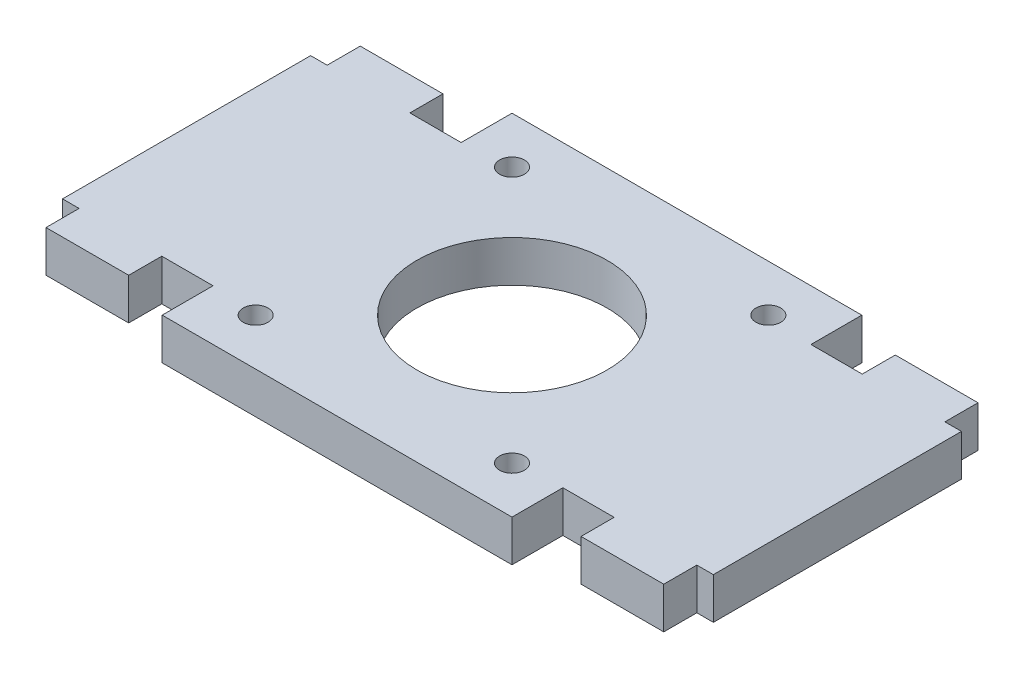
ISO-10303-21;
HEADER;
FILE_DESCRIPTION(('STEP AP214'),'2;1');
FILE_NAME('part.step','',(''),(''),'','','');
FILE_SCHEMA(('AUTOMOTIVE_DESIGN { 1 0 10303 214 1 1 1 1 }'));
ENDSEC;
DATA;
#1=APPLICATION_CONTEXT('core data for automotive mechanical design processes');
#2=APPLICATION_PROTOCOL_DEFINITION('international standard','automotive_design',2000,#1);
#3=PRODUCT_CONTEXT('',#1,'mechanical');
#4=PRODUCT('Part','Part','',(#3));
#5=PRODUCT_RELATED_PRODUCT_CATEGORY('part','',(#4));
#6=PRODUCT_DEFINITION_FORMATION('','',#4);
#7=PRODUCT_DEFINITION_CONTEXT('part definition',#1,'design');
#8=PRODUCT_DEFINITION('design','',#6,#7);
#9=PRODUCT_DEFINITION_SHAPE('','',#8);
#10=(LENGTH_UNIT() NAMED_UNIT(*) SI_UNIT(.MILLI.,.METRE.));
#11=(NAMED_UNIT(*) PLANE_ANGLE_UNIT() SI_UNIT($,.RADIAN.));
#12=(NAMED_UNIT(*) SI_UNIT($,.STERADIAN.) SOLID_ANGLE_UNIT());
#13=UNCERTAINTY_MEASURE_WITH_UNIT(LENGTH_MEASURE(1.E-05),#10,'distance_accuracy_value','');
#14=(GEOMETRIC_REPRESENTATION_CONTEXT(3) GLOBAL_UNCERTAINTY_ASSIGNED_CONTEXT((#13)) GLOBAL_UNIT_ASSIGNED_CONTEXT((#10,
#11,#12)) REPRESENTATION_CONTEXT('',''));
#15=CARTESIAN_POINT('',(0.,0.,0.));
#16=DIRECTION('',(0.,0.,1.));
#17=DIRECTION('',(1.,0.,0.));
#18=AXIS2_PLACEMENT_3D('',#15,#16,#17);
#19=CARTESIAN_POINT('',(0.,5.,15.));
#20=DIRECTION('',(0.,0.,-1.));
#21=DIRECTION('',(-1.,0.,0.));
#22=AXIS2_PLACEMENT_3D('',#19,#20,#21);
#23=PLANE('',#22);
#24=DIRECTION('',(1.,0.,0.));
#25=VECTOR('',#24,1.);
#26=CARTESIAN_POINT('',(0.,0.,15.));
#27=LINE('',#26,#25);
#28=CARTESIAN_POINT('',(-27.35,0.,15.));
#29=VERTEX_POINT('',#28);
#30=CARTESIAN_POINT('',(-21.15,0.,15.));
#31=VERTEX_POINT('',#30);
#32=EDGE_CURVE('E269',#29,#31,#27,.T.);
#33=ORIENTED_EDGE('',*,*,#32,.T.);
#34=DIRECTION('',(0.,-1.,0.));
#35=VECTOR('',#34,1.);
#36=CARTESIAN_POINT('',(-21.15,5.,15.));
#37=LINE('',#36,#35);
#38=CARTESIAN_POINT('',(-21.15,5.,15.));
#39=VERTEX_POINT('',#38);
#40=EDGE_CURVE('E11',#39,#31,#37,.T.);
#41=ORIENTED_EDGE('',*,*,#40,.F.);
#42=DIRECTION('',(1.,0.,0.));
#43=VECTOR('',#42,1.);
#44=CARTESIAN_POINT('',(0.,5.,15.));
#45=LINE('',#44,#43);
#46=CARTESIAN_POINT('',(-27.35,5.,15.));
#47=VERTEX_POINT('',#46);
#48=EDGE_CURVE('E479',#47,#39,#45,.T.);
#49=ORIENTED_EDGE('',*,*,#48,.F.);
#50=DIRECTION('',(0.,-1.,0.));
#51=VECTOR('',#50,1.);
#52=CARTESIAN_POINT('',(-27.35,5.,15.));
#53=LINE('',#52,#51);
#54=EDGE_CURVE('E250',#47,#29,#53,.T.);
#55=ORIENTED_EDGE('',*,*,#54,.T.);
#56=EDGE_LOOP('',(#33,#41,#49,#55));
#57=FACE_BOUND('',#56,.T.);
#58=ADVANCED_FACE('F37',(#57),#23,.F.);
#59=CARTESIAN_POINT('',(-21.15,5.,0.));
#60=DIRECTION('',(1.,0.,0.));
#61=DIRECTION('',(0.,0.,-1.));
#62=AXIS2_PLACEMENT_3D('',#59,#60,#61);
#63=PLANE('',#62);
#64=DIRECTION('',(0.,0.,1.));
#65=VECTOR('',#64,1.);
#66=CARTESIAN_POINT('',(-21.15,0.,0.));
#67=LINE('',#66,#65);
#68=CARTESIAN_POINT('',(-21.15,0.,21.15));
#69=VERTEX_POINT('',#68);
#70=EDGE_CURVE('E272',#31,#69,#67,.T.);
#71=ORIENTED_EDGE('',*,*,#70,.T.);
#72=DIRECTION('',(0.,-1.,0.));
#73=VECTOR('',#72,1.);
#74=CARTESIAN_POINT('',(-21.15,5.,21.15));
#75=LINE('',#74,#73);
#76=CARTESIAN_POINT('',(-21.15,5.,21.15));
#77=VERTEX_POINT('',#76);
#78=EDGE_CURVE('E46',#77,#69,#75,.T.);
#79=ORIENTED_EDGE('',*,*,#78,.F.);
#80=DIRECTION('',(0.,0.,1.));
#81=VECTOR('',#80,1.);
#82=CARTESIAN_POINT('',(-21.15,5.,0.));
#83=LINE('',#82,#81);
#84=EDGE_CURVE('E157',#39,#77,#83,.T.);
#85=ORIENTED_EDGE('',*,*,#84,.F.);
#86=ORIENTED_EDGE('',*,*,#40,.T.);
#87=EDGE_LOOP('',(#71,#79,#85,#86));
#88=FACE_BOUND('',#87,.T.);
#89=ADVANCED_FACE('F494',(#88),#63,.F.);
#90=CARTESIAN_POINT('',(0.,5.,21.15));
#91=DIRECTION('',(0.,0.,-1.));
#92=DIRECTION('',(-1.,0.,0.));
#93=AXIS2_PLACEMENT_3D('',#90,#91,#92);
#94=PLANE('',#93);
#95=DIRECTION('',(1.,0.,0.));
#96=VECTOR('',#95,1.);
#97=CARTESIAN_POINT('',(0.,0.,21.15));
#98=LINE('',#97,#96);
#99=CARTESIAN_POINT('',(21.15,0.,21.15));
#100=VERTEX_POINT('',#99);
#101=EDGE_CURVE('E274',#69,#100,#98,.T.);
#102=ORIENTED_EDGE('',*,*,#101,.T.);
#103=DIRECTION('',(0.,-1.,0.));
#104=VECTOR('',#103,1.);
#105=CARTESIAN_POINT('',(21.15,5.,21.15));
#106=LINE('',#105,#104);
#107=CARTESIAN_POINT('',(21.15,5.,21.15));
#108=VERTEX_POINT('',#107);
#109=EDGE_CURVE('E391',#108,#100,#106,.T.);
#110=ORIENTED_EDGE('',*,*,#109,.F.);
#111=DIRECTION('',(1.,0.,0.));
#112=VECTOR('',#111,1.);
#113=CARTESIAN_POINT('',(0.,5.,21.15));
#114=LINE('',#113,#112);
#115=EDGE_CURVE('E398',#77,#108,#114,.T.);
#116=ORIENTED_EDGE('',*,*,#115,.F.);
#117=ORIENTED_EDGE('',*,*,#78,.T.);
#118=EDGE_LOOP('',(#102,#110,#116,#117));
#119=FACE_BOUND('',#118,.T.);
#120=ADVANCED_FACE('F396',(#119),#94,.F.);
#121=CARTESIAN_POINT('',(21.15,5.,0.));
#122=DIRECTION('',(1.,0.,0.));
#123=DIRECTION('',(0.,0.,-1.));
#124=AXIS2_PLACEMENT_3D('',#121,#122,#123);
#125=PLANE('',#124);
#126=DIRECTION('',(0.,0.,1.));
#127=VECTOR('',#126,1.);
#128=CARTESIAN_POINT('',(21.15,0.,0.));
#129=LINE('',#128,#127);
#130=CARTESIAN_POINT('',(21.15,0.,15.));
#131=VERTEX_POINT('',#130);
#132=EDGE_CURVE('E277',#131,#100,#129,.T.);
#133=ORIENTED_EDGE('',*,*,#132,.F.);
#134=DIRECTION('',(0.,-1.,0.));
#135=VECTOR('',#134,1.);
#136=CARTESIAN_POINT('',(21.15,5.,15.));
#137=LINE('',#136,#135);
#138=CARTESIAN_POINT('',(21.15,5.,15.));
#139=VERTEX_POINT('',#138);
#140=EDGE_CURVE('E389',#139,#131,#137,.T.);
#141=ORIENTED_EDGE('',*,*,#140,.F.);
#142=DIRECTION('',(0.,0.,1.));
#143=VECTOR('',#142,1.);
#144=CARTESIAN_POINT('',(21.15,5.,0.));
#145=LINE('',#144,#143);
#146=EDGE_CURVE('E408',#139,#108,#145,.T.);
#147=ORIENTED_EDGE('',*,*,#146,.T.);
#148=ORIENTED_EDGE('',*,*,#109,.T.);
#149=EDGE_LOOP('',(#133,#141,#147,#148));
#150=FACE_BOUND('',#149,.T.);
#151=ADVANCED_FACE('F405',(#150),#125,.T.);
#152=CARTESIAN_POINT('',(0.,5.,15.));
#153=DIRECTION('',(0.,0.,1.));
#154=DIRECTION('',(1.,0.,0.));
#155=AXIS2_PLACEMENT_3D('',#152,#153,#154);
#156=PLANE('',#155);
#157=DIRECTION('',(-1.,0.,0.));
#158=VECTOR('',#157,1.);
#159=CARTESIAN_POINT('',(0.,0.,15.));
#160=LINE('',#159,#158);
#161=CARTESIAN_POINT('',(27.35,0.,15.));
#162=VERTEX_POINT('',#161);
#163=EDGE_CURVE('E280',#162,#131,#160,.T.);
#164=ORIENTED_EDGE('',*,*,#163,.F.);
#165=DIRECTION('',(0.,-1.,0.));
#166=VECTOR('',#165,1.);
#167=CARTESIAN_POINT('',(27.35,5.,15.));
#168=LINE('',#167,#166);
#169=CARTESIAN_POINT('',(27.35,5.,15.));
#170=VERTEX_POINT('',#169);
#171=EDGE_CURVE('E387',#170,#162,#168,.T.);
#172=ORIENTED_EDGE('',*,*,#171,.F.);
#173=DIRECTION('',(-1.,0.,0.));
#174=VECTOR('',#173,1.);
#175=CARTESIAN_POINT('',(0.,5.,15.));
#176=LINE('',#175,#174);
#177=EDGE_CURVE('E411',#170,#139,#176,.T.);
#178=ORIENTED_EDGE('',*,*,#177,.T.);
#179=ORIENTED_EDGE('',*,*,#140,.T.);
#180=EDGE_LOOP('',(#164,#172,#178,#179));
#181=FACE_BOUND('',#180,.T.);
#182=ADVANCED_FACE('F813',(#181),#156,.T.);
#183=CARTESIAN_POINT('',(27.35,5.,0.));
#184=DIRECTION('',(-1.,0.,0.));
#185=DIRECTION('',(0.,0.,1.));
#186=AXIS2_PLACEMENT_3D('',#183,#184,#185);
#187=PLANE('',#186);
#188=DIRECTION('',(0.,0.,-1.));
#189=VECTOR('',#188,1.);
#190=CARTESIAN_POINT('',(27.35,0.,0.));
#191=LINE('',#190,#189);
#192=CARTESIAN_POINT('',(27.35,0.,19.));
#193=VERTEX_POINT('',#192);
#194=EDGE_CURVE('E283',#193,#162,#191,.T.);
#195=ORIENTED_EDGE('',*,*,#194,.F.);
#196=DIRECTION('',(0.,-1.,0.));
#197=VECTOR('',#196,1.);
#198=CARTESIAN_POINT('',(27.35,5.,19.));
#199=LINE('',#198,#197);
#200=CARTESIAN_POINT('',(27.35,5.,19.));
#201=VERTEX_POINT('',#200);
#202=EDGE_CURVE('E385',#201,#193,#199,.T.);
#203=ORIENTED_EDGE('',*,*,#202,.F.);
#204=DIRECTION('',(0.,0.,-1.));
#205=VECTOR('',#204,1.);
#206=CARTESIAN_POINT('',(27.35,5.,0.));
#207=LINE('',#206,#205);
#208=EDGE_CURVE('E413',#201,#170,#207,.T.);
#209=ORIENTED_EDGE('',*,*,#208,.T.);
#210=ORIENTED_EDGE('',*,*,#171,.T.);
#211=EDGE_LOOP('',(#195,#203,#209,#210));
#212=FACE_BOUND('',#211,.T.);
#213=ADVANCED_FACE('F802',(#212),#187,.T.);
#214=CARTESIAN_POINT('',(0.,5.,19.));
#215=DIRECTION('',(0.,0.,1.));
#216=DIRECTION('',(1.,0.,0.));
#217=AXIS2_PLACEMENT_3D('',#214,#215,#216);
#218=PLANE('',#217);
#219=DIRECTION('',(-1.,0.,0.));
#220=VECTOR('',#219,1.);
#221=CARTESIAN_POINT('',(0.,0.,19.));
#222=LINE('',#221,#220);
#223=CARTESIAN_POINT('',(37.35,0.,19.));
#224=VERTEX_POINT('',#223);
#225=EDGE_CURVE('E286',#224,#193,#222,.T.);
#226=ORIENTED_EDGE('',*,*,#225,.F.);
#227=DIRECTION('',(0.,-1.,0.));
#228=VECTOR('',#227,1.);
#229=CARTESIAN_POINT('',(37.35,5.,19.));
#230=LINE('',#229,#228);
#231=CARTESIAN_POINT('',(37.35,5.,19.));
#232=VERTEX_POINT('',#231);
#233=EDGE_CURVE('E383',#232,#224,#230,.T.);
#234=ORIENTED_EDGE('',*,*,#233,.F.);
#235=DIRECTION('',(-1.,0.,0.));
#236=VECTOR('',#235,1.);
#237=CARTESIAN_POINT('',(0.,5.,19.));
#238=LINE('',#237,#236);
#239=EDGE_CURVE('E420',#232,#201,#238,.T.);
#240=ORIENTED_EDGE('',*,*,#239,.T.);
#241=ORIENTED_EDGE('',*,*,#202,.T.);
#242=EDGE_LOOP('',(#226,#234,#240,#241));
#243=FACE_BOUND('',#242,.T.);
#244=ADVANCED_FACE('F791',(#243),#218,.T.);
#245=CARTESIAN_POINT('',(37.35,5.,0.));
#246=DIRECTION('',(1.,0.,0.));
#247=DIRECTION('',(0.,0.,-1.));
#248=AXIS2_PLACEMENT_3D('',#245,#246,#247);
#249=PLANE('',#248);
#250=DIRECTION('',(0.,0.,1.));
#251=VECTOR('',#250,1.);
#252=CARTESIAN_POINT('',(37.35,0.,0.));
#253=LINE('',#252,#251);
#254=CARTESIAN_POINT('',(37.35,0.,15.));
#255=VERTEX_POINT('',#254);
#256=EDGE_CURVE('E289',#255,#224,#253,.T.);
#257=ORIENTED_EDGE('',*,*,#256,.F.);
#258=DIRECTION('',(0.,-1.,0.));
#259=VECTOR('',#258,1.);
#260=CARTESIAN_POINT('',(37.35,5.,15.));
#261=LINE('',#260,#259);
#262=CARTESIAN_POINT('',(37.35,5.,15.));
#263=VERTEX_POINT('',#262);
#264=EDGE_CURVE('E381',#263,#255,#261,.T.);
#265=ORIENTED_EDGE('',*,*,#264,.F.);
#266=DIRECTION('',(0.,0.,1.));
#267=VECTOR('',#266,1.);
#268=CARTESIAN_POINT('',(37.35,5.,0.));
#269=LINE('',#268,#267);
#270=EDGE_CURVE('E423',#263,#232,#269,.T.);
#271=ORIENTED_EDGE('',*,*,#270,.T.);
#272=ORIENTED_EDGE('',*,*,#233,.T.);
#273=EDGE_LOOP('',(#257,#265,#271,#272));
#274=FACE_BOUND('',#273,.T.);
#275=ADVANCED_FACE('F780',(#274),#249,.T.);
#276=CARTESIAN_POINT('',(0.,5.,15.));
#277=DIRECTION('',(0.,0.,1.));
#278=DIRECTION('',(1.,0.,0.));
#279=AXIS2_PLACEMENT_3D('',#276,#277,#278);
#280=PLANE('',#279);
#281=DIRECTION('',(-1.,0.,0.));
#282=VECTOR('',#281,1.);
#283=CARTESIAN_POINT('',(0.,0.,15.));
#284=LINE('',#283,#282);
#285=CARTESIAN_POINT('',(39.35,0.,15.));
#286=VERTEX_POINT('',#285);
#287=EDGE_CURVE('E292',#286,#255,#284,.T.);
#288=ORIENTED_EDGE('',*,*,#287,.F.);
#289=DIRECTION('',(0.,-1.,0.));
#290=VECTOR('',#289,1.);
#291=CARTESIAN_POINT('',(39.35,5.,15.));
#292=LINE('',#291,#290);
#293=CARTESIAN_POINT('',(39.35,5.,15.));
#294=VERTEX_POINT('',#293);
#295=EDGE_CURVE('E379',#294,#286,#292,.T.);
#296=ORIENTED_EDGE('',*,*,#295,.F.);
#297=DIRECTION('',(-1.,0.,0.));
#298=VECTOR('',#297,1.);
#299=CARTESIAN_POINT('',(0.,5.,15.));
#300=LINE('',#299,#298);
#301=EDGE_CURVE('E426',#294,#263,#300,.T.);
#302=ORIENTED_EDGE('',*,*,#301,.T.);
#303=ORIENTED_EDGE('',*,*,#264,.T.);
#304=EDGE_LOOP('',(#288,#296,#302,#303));
#305=FACE_BOUND('',#304,.T.);
#306=ADVANCED_FACE('F769',(#305),#280,.T.);
#307=CARTESIAN_POINT('',(39.35,5.,0.));
#308=DIRECTION('',(1.,0.,0.));
#309=DIRECTION('',(0.,0.,-1.));
#310=AXIS2_PLACEMENT_3D('',#307,#308,#309);
#311=PLANE('',#310);
#312=DIRECTION('',(0.,0.,1.));
#313=VECTOR('',#312,1.);
#314=CARTESIAN_POINT('',(39.35,0.,0.));
#315=LINE('',#314,#313);
#316=CARTESIAN_POINT('',(39.35,0.,-15.));
#317=VERTEX_POINT('',#316);
#318=EDGE_CURVE('E295',#317,#286,#315,.T.);
#319=ORIENTED_EDGE('',*,*,#318,.F.);
#320=DIRECTION('',(0.,-1.,0.));
#321=VECTOR('',#320,1.);
#322=CARTESIAN_POINT('',(39.35,5.,-15.));
#323=LINE('',#322,#321);
#324=CARTESIAN_POINT('',(39.35,5.,-15.));
#325=VERTEX_POINT('',#324);
#326=EDGE_CURVE('E377',#325,#317,#323,.T.);
#327=ORIENTED_EDGE('',*,*,#326,.F.);
#328=DIRECTION('',(0.,0.,1.));
#329=VECTOR('',#328,1.);
#330=CARTESIAN_POINT('',(39.35,5.,0.));
#331=LINE('',#330,#329);
#332=EDGE_CURVE('E429',#325,#294,#331,.T.);
#333=ORIENTED_EDGE('',*,*,#332,.T.);
#334=ORIENTED_EDGE('',*,*,#295,.T.);
#335=EDGE_LOOP('',(#319,#327,#333,#334));
#336=FACE_BOUND('',#335,.T.);
#337=ADVANCED_FACE('F758',(#336),#311,.T.);
#338=CARTESIAN_POINT('',(0.,5.,-15.));
#339=DIRECTION('',(0.,0.,1.));
#340=DIRECTION('',(1.,0.,0.));
#341=AXIS2_PLACEMENT_3D('',#338,#339,#340);
#342=PLANE('',#341);
#343=DIRECTION('',(-1.,0.,0.));
#344=VECTOR('',#343,1.);
#345=CARTESIAN_POINT('',(0.,0.,-15.));
#346=LINE('',#345,#344);
#347=CARTESIAN_POINT('',(37.35,0.,-15.));
#348=VERTEX_POINT('',#347);
#349=EDGE_CURVE('E298',#317,#348,#346,.T.);
#350=ORIENTED_EDGE('',*,*,#349,.T.);
#351=DIRECTION('',(0.,-1.,0.));
#352=VECTOR('',#351,1.);
#353=CARTESIAN_POINT('',(37.35,5.,-15.));
#354=LINE('',#353,#352);
#355=CARTESIAN_POINT('',(37.35,5.,-15.));
#356=VERTEX_POINT('',#355);
#357=EDGE_CURVE('E374',#356,#348,#354,.T.);
#358=ORIENTED_EDGE('',*,*,#357,.F.);
#359=DIRECTION('',(-1.,0.,0.));
#360=VECTOR('',#359,1.);
#361=CARTESIAN_POINT('',(0.,5.,-15.));
#362=LINE('',#361,#360);
#363=EDGE_CURVE('E432',#325,#356,#362,.T.);
#364=ORIENTED_EDGE('',*,*,#363,.F.);
#365=ORIENTED_EDGE('',*,*,#326,.T.);
#366=EDGE_LOOP('',(#350,#358,#364,#365));
#367=FACE_BOUND('',#366,.T.);
#368=ADVANCED_FACE('F747',(#367),#342,.F.);
#369=CARTESIAN_POINT('',(37.35,5.,0.));
#370=DIRECTION('',(-1.,0.,0.));
#371=DIRECTION('',(0.,0.,1.));
#372=AXIS2_PLACEMENT_3D('',#369,#370,#371);
#373=PLANE('',#372);
#374=DIRECTION('',(0.,0.,-1.));
#375=VECTOR('',#374,1.);
#376=CARTESIAN_POINT('',(37.35,0.,0.));
#377=LINE('',#376,#375);
#378=CARTESIAN_POINT('',(37.35,0.,-19.));
#379=VERTEX_POINT('',#378);
#380=EDGE_CURVE('E300',#348,#379,#377,.T.);
#381=ORIENTED_EDGE('',*,*,#380,.T.);
#382=DIRECTION('',(0.,-1.,0.));
#383=VECTOR('',#382,1.);
#384=CARTESIAN_POINT('',(37.35,5.,-19.));
#385=LINE('',#384,#383);
#386=CARTESIAN_POINT('',(37.35,5.,-19.));
#387=VERTEX_POINT('',#386);
#388=EDGE_CURVE('E371',#387,#379,#385,.T.);
#389=ORIENTED_EDGE('',*,*,#388,.F.);
#390=DIRECTION('',(0.,0.,-1.));
#391=VECTOR('',#390,1.);
#392=CARTESIAN_POINT('',(37.35,5.,0.));
#393=LINE('',#392,#391);
#394=EDGE_CURVE('E434',#356,#387,#393,.T.);
#395=ORIENTED_EDGE('',*,*,#394,.F.);
#396=ORIENTED_EDGE('',*,*,#357,.T.);
#397=EDGE_LOOP('',(#381,#389,#395,#396));
#398=FACE_BOUND('',#397,.T.);
#399=ADVANCED_FACE('F736',(#398),#373,.F.);
#400=CARTESIAN_POINT('',(0.,5.,-19.));
#401=DIRECTION('',(0.,0.,1.));
#402=DIRECTION('',(1.,0.,0.));
#403=AXIS2_PLACEMENT_3D('',#400,#401,#402);
#404=PLANE('',#403);
#405=DIRECTION('',(-1.,0.,0.));
#406=VECTOR('',#405,1.);
#407=CARTESIAN_POINT('',(0.,0.,-19.));
#408=LINE('',#407,#406);
#409=CARTESIAN_POINT('',(27.35,0.,-19.));
#410=VERTEX_POINT('',#409);
#411=EDGE_CURVE('E302',#379,#410,#408,.T.);
#412=ORIENTED_EDGE('',*,*,#411,.T.);
#413=DIRECTION('',(0.,-1.,0.));
#414=VECTOR('',#413,1.);
#415=CARTESIAN_POINT('',(27.35,5.,-19.));
#416=LINE('',#415,#414);
#417=CARTESIAN_POINT('',(27.35,5.,-19.));
#418=VERTEX_POINT('',#417);
#419=EDGE_CURVE('E368',#418,#410,#416,.T.);
#420=ORIENTED_EDGE('',*,*,#419,.F.);
#421=DIRECTION('',(-1.,0.,0.));
#422=VECTOR('',#421,1.);
#423=CARTESIAN_POINT('',(0.,5.,-19.));
#424=LINE('',#423,#422);
#425=EDGE_CURVE('E436',#387,#418,#424,.T.);
#426=ORIENTED_EDGE('',*,*,#425,.F.);
#427=ORIENTED_EDGE('',*,*,#388,.T.);
#428=EDGE_LOOP('',(#412,#420,#426,#427));
#429=FACE_BOUND('',#428,.T.);
#430=ADVANCED_FACE('F725',(#429),#404,.F.);
#431=CARTESIAN_POINT('',(27.35,5.,0.));
#432=DIRECTION('',(1.,0.,0.));
#433=DIRECTION('',(0.,0.,-1.));
#434=AXIS2_PLACEMENT_3D('',#431,#432,#433);
#435=PLANE('',#434);
#436=DIRECTION('',(0.,0.,1.));
#437=VECTOR('',#436,1.);
#438=CARTESIAN_POINT('',(27.35,0.,0.));
#439=LINE('',#438,#437);
#440=CARTESIAN_POINT('',(27.35,0.,-15.));
#441=VERTEX_POINT('',#440);
#442=EDGE_CURVE('E304',#410,#441,#439,.T.);
#443=ORIENTED_EDGE('',*,*,#442,.T.);
#444=DIRECTION('',(0.,-1.,0.));
#445=VECTOR('',#444,1.);
#446=CARTESIAN_POINT('',(27.35,5.,-15.));
#447=LINE('',#446,#445);
#448=CARTESIAN_POINT('',(27.35,5.,-15.));
#449=VERTEX_POINT('',#448);
#450=EDGE_CURVE('E365',#449,#441,#447,.T.);
#451=ORIENTED_EDGE('',*,*,#450,.F.);
#452=DIRECTION('',(0.,0.,1.));
#453=VECTOR('',#452,1.);
#454=CARTESIAN_POINT('',(27.35,5.,0.));
#455=LINE('',#454,#453);
#456=EDGE_CURVE('E438',#418,#449,#455,.T.);
#457=ORIENTED_EDGE('',*,*,#456,.F.);
#458=ORIENTED_EDGE('',*,*,#419,.T.);
#459=EDGE_LOOP('',(#443,#451,#457,#458));
#460=FACE_BOUND('',#459,.T.);
#461=ADVANCED_FACE('F714',(#460),#435,.F.);
#462=CARTESIAN_POINT('',(0.,5.,-15.));
#463=DIRECTION('',(0.,0.,1.));
#464=DIRECTION('',(1.,0.,0.));
#465=AXIS2_PLACEMENT_3D('',#462,#463,#464);
#466=PLANE('',#465);
#467=DIRECTION('',(-1.,0.,0.));
#468=VECTOR('',#467,1.);
#469=CARTESIAN_POINT('',(0.,0.,-15.));
#470=LINE('',#469,#468);
#471=CARTESIAN_POINT('',(21.15,0.,-15.));
#472=VERTEX_POINT('',#471);
#473=EDGE_CURVE('E306',#441,#472,#470,.T.);
#474=ORIENTED_EDGE('',*,*,#473,.T.);
#475=DIRECTION('',(0.,-1.,0.));
#476=VECTOR('',#475,1.);
#477=CARTESIAN_POINT('',(21.15,5.,-15.));
#478=LINE('',#477,#476);
#479=CARTESIAN_POINT('',(21.15,5.,-15.));
#480=VERTEX_POINT('',#479);
#481=EDGE_CURVE('E362',#480,#472,#478,.T.);
#482=ORIENTED_EDGE('',*,*,#481,.F.);
#483=DIRECTION('',(-1.,0.,0.));
#484=VECTOR('',#483,1.);
#485=CARTESIAN_POINT('',(0.,5.,-15.));
#486=LINE('',#485,#484);
#487=EDGE_CURVE('E440',#449,#480,#486,.T.);
#488=ORIENTED_EDGE('',*,*,#487,.F.);
#489=ORIENTED_EDGE('',*,*,#450,.T.);
#490=EDGE_LOOP('',(#474,#482,#488,#489));
#491=FACE_BOUND('',#490,.T.);
#492=ADVANCED_FACE('F703',(#491),#466,.F.);
#493=CARTESIAN_POINT('',(21.15,5.,0.));
#494=DIRECTION('',(-1.,0.,0.));
#495=DIRECTION('',(0.,0.,1.));
#496=AXIS2_PLACEMENT_3D('',#493,#494,#495);
#497=PLANE('',#496);
#498=DIRECTION('',(0.,0.,-1.));
#499=VECTOR('',#498,1.);
#500=CARTESIAN_POINT('',(21.15,0.,0.));
#501=LINE('',#500,#499);
#502=CARTESIAN_POINT('',(21.15,0.,-21.15));
#503=VERTEX_POINT('',#502);
#504=EDGE_CURVE('E308',#472,#503,#501,.T.);
#505=ORIENTED_EDGE('',*,*,#504,.T.);
#506=DIRECTION('',(0.,-1.,0.));
#507=VECTOR('',#506,1.);
#508=CARTESIAN_POINT('',(21.15,5.,-21.15));
#509=LINE('',#508,#507);
#510=CARTESIAN_POINT('',(21.15,5.,-21.15));
#511=VERTEX_POINT('',#510);
#512=EDGE_CURVE('E360',#511,#503,#509,.T.);
#513=ORIENTED_EDGE('',*,*,#512,.F.);
#514=DIRECTION('',(0.,0.,-1.));
#515=VECTOR('',#514,1.);
#516=CARTESIAN_POINT('',(21.15,5.,0.));
#517=LINE('',#516,#515);
#518=EDGE_CURVE('E442',#480,#511,#517,.T.);
#519=ORIENTED_EDGE('',*,*,#518,.F.);
#520=ORIENTED_EDGE('',*,*,#481,.T.);
#521=EDGE_LOOP('',(#505,#513,#519,#520));
#522=FACE_BOUND('',#521,.T.);
#523=ADVANCED_FACE('F692',(#522),#497,.F.);
#524=CARTESIAN_POINT('',(0.,5.,-21.15));
#525=DIRECTION('',(0.,0.,-1.));
#526=DIRECTION('',(-1.,0.,0.));
#527=AXIS2_PLACEMENT_3D('',#524,#525,#526);
#528=PLANE('',#527);
#529=DIRECTION('',(1.,0.,0.));
#530=VECTOR('',#529,1.);
#531=CARTESIAN_POINT('',(0.,0.,-21.15));
#532=LINE('',#531,#530);
#533=CARTESIAN_POINT('',(-21.15,0.,-21.15));
#534=VERTEX_POINT('',#533);
#535=EDGE_CURVE('E311',#534,#503,#532,.T.);
#536=ORIENTED_EDGE('',*,*,#535,.F.);
#537=DIRECTION('',(0.,-1.,0.));
#538=VECTOR('',#537,1.);
#539=CARTESIAN_POINT('',(-21.15,5.,-21.15));
#540=LINE('',#539,#538);
#541=CARTESIAN_POINT('',(-21.15,5.,-21.15));
#542=VERTEX_POINT('',#541);
#543=EDGE_CURVE('E358',#542,#534,#540,.T.);
#544=ORIENTED_EDGE('',*,*,#543,.F.);
#545=DIRECTION('',(1.,0.,0.));
#546=VECTOR('',#545,1.);
#547=CARTESIAN_POINT('',(0.,5.,-21.15));
#548=LINE('',#547,#546);
#549=EDGE_CURVE('E444',#542,#511,#548,.T.);
#550=ORIENTED_EDGE('',*,*,#549,.T.);
#551=ORIENTED_EDGE('',*,*,#512,.T.);
#552=EDGE_LOOP('',(#536,#544,#550,#551));
#553=FACE_BOUND('',#552,.T.);
#554=ADVANCED_FACE('F681',(#553),#528,.T.);
#555=CARTESIAN_POINT('',(-21.15,5.,0.));
#556=DIRECTION('',(-1.,0.,0.));
#557=DIRECTION('',(0.,0.,1.));
#558=AXIS2_PLACEMENT_3D('',#555,#556,#557);
#559=PLANE('',#558);
#560=DIRECTION('',(0.,0.,-1.));
#561=VECTOR('',#560,1.);
#562=CARTESIAN_POINT('',(-21.15,0.,0.));
#563=LINE('',#562,#561);
#564=CARTESIAN_POINT('',(-21.15,0.,-15.));
#565=VERTEX_POINT('',#564);
#566=EDGE_CURVE('E314',#565,#534,#563,.T.);
#567=ORIENTED_EDGE('',*,*,#566,.F.);
#568=DIRECTION('',(0.,-1.,0.));
#569=VECTOR('',#568,1.);
#570=CARTESIAN_POINT('',(-21.15,5.,-15.));
#571=LINE('',#570,#569);
#572=CARTESIAN_POINT('',(-21.15,5.,-15.));
#573=VERTEX_POINT('',#572);
#574=EDGE_CURVE('E356',#573,#565,#571,.T.);
#575=ORIENTED_EDGE('',*,*,#574,.F.);
#576=DIRECTION('',(0.,0.,-1.));
#577=VECTOR('',#576,1.);
#578=CARTESIAN_POINT('',(-21.15,5.,0.));
#579=LINE('',#578,#577);
#580=EDGE_CURVE('E447',#573,#542,#579,.T.);
#581=ORIENTED_EDGE('',*,*,#580,.T.);
#582=ORIENTED_EDGE('',*,*,#543,.T.);
#583=EDGE_LOOP('',(#567,#575,#581,#582));
#584=FACE_BOUND('',#583,.T.);
#585=ADVANCED_FACE('F670',(#584),#559,.T.);
#586=CARTESIAN_POINT('',(0.,5.,-15.));
#587=DIRECTION('',(0.,0.,-1.));
#588=DIRECTION('',(-1.,0.,0.));
#589=AXIS2_PLACEMENT_3D('',#586,#587,#588);
#590=PLANE('',#589);
#591=DIRECTION('',(1.,0.,0.));
#592=VECTOR('',#591,1.);
#593=CARTESIAN_POINT('',(0.,0.,-15.));
#594=LINE('',#593,#592);
#595=CARTESIAN_POINT('',(-27.35,0.,-15.));
#596=VERTEX_POINT('',#595);
#597=EDGE_CURVE('E317',#596,#565,#594,.T.);
#598=ORIENTED_EDGE('',*,*,#597,.F.);
#599=DIRECTION('',(0.,-1.,0.));
#600=VECTOR('',#599,1.);
#601=CARTESIAN_POINT('',(-27.35,5.,-15.));
#602=LINE('',#601,#600);
#603=CARTESIAN_POINT('',(-27.35,5.,-15.));
#604=VERTEX_POINT('',#603);
#605=EDGE_CURVE('E354',#604,#596,#602,.T.);
#606=ORIENTED_EDGE('',*,*,#605,.F.);
#607=DIRECTION('',(1.,0.,0.));
#608=VECTOR('',#607,1.);
#609=CARTESIAN_POINT('',(0.,5.,-15.));
#610=LINE('',#609,#608);
#611=EDGE_CURVE('E450',#604,#573,#610,.T.);
#612=ORIENTED_EDGE('',*,*,#611,.T.);
#613=ORIENTED_EDGE('',*,*,#574,.T.);
#614=EDGE_LOOP('',(#598,#606,#612,#613));
#615=FACE_BOUND('',#614,.T.);
#616=ADVANCED_FACE('F659',(#615),#590,.T.);
#617=CARTESIAN_POINT('',(-27.35,5.,0.));
#618=DIRECTION('',(1.,0.,0.));
#619=DIRECTION('',(0.,0.,-1.));
#620=AXIS2_PLACEMENT_3D('',#617,#618,#619);
#621=PLANE('',#620);
#622=DIRECTION('',(0.,0.,1.));
#623=VECTOR('',#622,1.);
#624=CARTESIAN_POINT('',(-27.35,0.,0.));
#625=LINE('',#624,#623);
#626=CARTESIAN_POINT('',(-27.35,0.,-19.));
#627=VERTEX_POINT('',#626);
#628=EDGE_CURVE('E320',#627,#596,#625,.T.);
#629=ORIENTED_EDGE('',*,*,#628,.F.);
#630=DIRECTION('',(0.,-1.,0.));
#631=VECTOR('',#630,1.);
#632=CARTESIAN_POINT('',(-27.35,5.,-19.));
#633=LINE('',#632,#631);
#634=CARTESIAN_POINT('',(-27.35,5.,-19.));
#635=VERTEX_POINT('',#634);
#636=EDGE_CURVE('E352',#635,#627,#633,.T.);
#637=ORIENTED_EDGE('',*,*,#636,.F.);
#638=DIRECTION('',(0.,0.,1.));
#639=VECTOR('',#638,1.);
#640=CARTESIAN_POINT('',(-27.35,5.,0.));
#641=LINE('',#640,#639);
#642=EDGE_CURVE('E453',#635,#604,#641,.T.);
#643=ORIENTED_EDGE('',*,*,#642,.T.);
#644=ORIENTED_EDGE('',*,*,#605,.T.);
#645=EDGE_LOOP('',(#629,#637,#643,#644));
#646=FACE_BOUND('',#645,.T.);
#647=ADVANCED_FACE('F648',(#646),#621,.T.);
#648=CARTESIAN_POINT('',(0.,5.,-19.));
#649=DIRECTION('',(0.,0.,-1.));
#650=DIRECTION('',(-1.,0.,0.));
#651=AXIS2_PLACEMENT_3D('',#648,#649,#650);
#652=PLANE('',#651);
#653=DIRECTION('',(1.,0.,0.));
#654=VECTOR('',#653,1.);
#655=CARTESIAN_POINT('',(0.,0.,-19.));
#656=LINE('',#655,#654);
#657=CARTESIAN_POINT('',(-37.35,0.,-19.));
#658=VERTEX_POINT('',#657);
#659=EDGE_CURVE('E323',#658,#627,#656,.T.);
#660=ORIENTED_EDGE('',*,*,#659,.F.);
#661=DIRECTION('',(0.,-1.,0.));
#662=VECTOR('',#661,1.);
#663=CARTESIAN_POINT('',(-37.35,5.,-19.));
#664=LINE('',#663,#662);
#665=CARTESIAN_POINT('',(-37.35,5.,-19.));
#666=VERTEX_POINT('',#665);
#667=EDGE_CURVE('E350',#666,#658,#664,.T.);
#668=ORIENTED_EDGE('',*,*,#667,.F.);
#669=DIRECTION('',(1.,0.,0.));
#670=VECTOR('',#669,1.);
#671=CARTESIAN_POINT('',(0.,5.,-19.));
#672=LINE('',#671,#670);
#673=EDGE_CURVE('E456',#666,#635,#672,.T.);
#674=ORIENTED_EDGE('',*,*,#673,.T.);
#675=ORIENTED_EDGE('',*,*,#636,.T.);
#676=EDGE_LOOP('',(#660,#668,#674,#675));
#677=FACE_BOUND('',#676,.T.);
#678=ADVANCED_FACE('F637',(#677),#652,.T.);
#679=CARTESIAN_POINT('',(-37.35,5.,0.));
#680=DIRECTION('',(-1.,0.,0.));
#681=DIRECTION('',(0.,0.,1.));
#682=AXIS2_PLACEMENT_3D('',#679,#680,#681);
#683=PLANE('',#682);
#684=DIRECTION('',(0.,0.,-1.));
#685=VECTOR('',#684,1.);
#686=CARTESIAN_POINT('',(-37.35,0.,0.));
#687=LINE('',#686,#685);
#688=CARTESIAN_POINT('',(-37.35,0.,-15.));
#689=VERTEX_POINT('',#688);
#690=EDGE_CURVE('E326',#689,#658,#687,.T.);
#691=ORIENTED_EDGE('',*,*,#690,.F.);
#692=DIRECTION('',(0.,-1.,0.));
#693=VECTOR('',#692,1.);
#694=CARTESIAN_POINT('',(-37.35,5.,-15.));
#695=LINE('',#694,#693);
#696=CARTESIAN_POINT('',(-37.35,5.,-15.));
#697=VERTEX_POINT('',#696);
#698=EDGE_CURVE('E348',#697,#689,#695,.T.);
#699=ORIENTED_EDGE('',*,*,#698,.F.);
#700=DIRECTION('',(0.,0.,-1.));
#701=VECTOR('',#700,1.);
#702=CARTESIAN_POINT('',(-37.35,5.,0.));
#703=LINE('',#702,#701);
#704=EDGE_CURVE('E459',#697,#666,#703,.T.);
#705=ORIENTED_EDGE('',*,*,#704,.T.);
#706=ORIENTED_EDGE('',*,*,#667,.T.);
#707=EDGE_LOOP('',(#691,#699,#705,#706));
#708=FACE_BOUND('',#707,.T.);
#709=ADVANCED_FACE('F626',(#708),#683,.T.);
#710=CARTESIAN_POINT('',(0.,5.,-15.));
#711=DIRECTION('',(0.,0.,-1.));
#712=DIRECTION('',(-1.,0.,0.));
#713=AXIS2_PLACEMENT_3D('',#710,#711,#712);
#714=PLANE('',#713);
#715=DIRECTION('',(1.,0.,0.));
#716=VECTOR('',#715,1.);
#717=CARTESIAN_POINT('',(0.,0.,-15.));
#718=LINE('',#717,#716);
#719=CARTESIAN_POINT('',(-39.35,0.,-15.));
#720=VERTEX_POINT('',#719);
#721=EDGE_CURVE('E329',#720,#689,#718,.T.);
#722=ORIENTED_EDGE('',*,*,#721,.F.);
#723=DIRECTION('',(0.,-1.,0.));
#724=VECTOR('',#723,1.);
#725=CARTESIAN_POINT('',(-39.35,5.,-15.));
#726=LINE('',#725,#724);
#727=CARTESIAN_POINT('',(-39.35,5.,-15.));
#728=VERTEX_POINT('',#727);
#729=EDGE_CURVE('E346',#728,#720,#726,.T.);
#730=ORIENTED_EDGE('',*,*,#729,.F.);
#731=DIRECTION('',(1.,0.,0.));
#732=VECTOR('',#731,1.);
#733=CARTESIAN_POINT('',(0.,5.,-15.));
#734=LINE('',#733,#732);
#735=EDGE_CURVE('E462',#728,#697,#734,.T.);
#736=ORIENTED_EDGE('',*,*,#735,.T.);
#737=ORIENTED_EDGE('',*,*,#698,.T.);
#738=EDGE_LOOP('',(#722,#730,#736,#737));
#739=FACE_BOUND('',#738,.T.);
#740=ADVANCED_FACE('F616',(#739),#714,.T.);
#741=CARTESIAN_POINT('',(-39.35,5.,0.));
#742=DIRECTION('',(1.,0.,0.));
#743=DIRECTION('',(0.,0.,-1.));
#744=AXIS2_PLACEMENT_3D('',#741,#742,#743);
#745=PLANE('',#744);
#746=DIRECTION('',(0.,0.,1.));
#747=VECTOR('',#746,1.);
#748=CARTESIAN_POINT('',(-39.35,0.,0.));
#749=LINE('',#748,#747);
#750=CARTESIAN_POINT('',(-39.35,0.,15.));
#751=VERTEX_POINT('',#750);
#752=EDGE_CURVE('E332',#720,#751,#749,.T.);
#753=ORIENTED_EDGE('',*,*,#752,.T.);
#754=DIRECTION('',(0.,-1.,0.));
#755=VECTOR('',#754,1.);
#756=CARTESIAN_POINT('',(-39.35,5.,15.));
#757=LINE('',#756,#755);
#758=CARTESIAN_POINT('',(-39.35,5.,15.));
#759=VERTEX_POINT('',#758);
#760=EDGE_CURVE('E343',#759,#751,#757,.T.);
#761=ORIENTED_EDGE('',*,*,#760,.F.);
#762=DIRECTION('',(0.,0.,1.));
#763=VECTOR('',#762,1.);
#764=CARTESIAN_POINT('',(-39.35,5.,0.));
#765=LINE('',#764,#763);
#766=EDGE_CURVE('E465',#728,#759,#765,.T.);
#767=ORIENTED_EDGE('',*,*,#766,.F.);
#768=ORIENTED_EDGE('',*,*,#729,.T.);
#769=EDGE_LOOP('',(#753,#761,#767,#768));
#770=FACE_BOUND('',#769,.T.);
#771=ADVANCED_FACE('F471',(#770),#745,.F.);
#772=CARTESIAN_POINT('',(0.,5.,15.));
#773=DIRECTION('',(0.,0.,-1.));
#774=DIRECTION('',(-1.,0.,0.));
#775=AXIS2_PLACEMENT_3D('',#772,#773,#774);
#776=PLANE('',#775);
#777=DIRECTION('',(1.,0.,0.));
#778=VECTOR('',#777,1.);
#779=CARTESIAN_POINT('',(0.,0.,15.));
#780=LINE('',#779,#778);
#781=CARTESIAN_POINT('',(-37.35,0.,15.));
#782=VERTEX_POINT('',#781);
#783=EDGE_CURVE('E334',#751,#782,#780,.T.);
#784=ORIENTED_EDGE('',*,*,#783,.T.);
#785=DIRECTION('',(0.,-1.,0.));
#786=VECTOR('',#785,1.);
#787=CARTESIAN_POINT('',(-37.35,5.,15.));
#788=LINE('',#787,#786);
#789=CARTESIAN_POINT('',(-37.35,5.,15.));
#790=VERTEX_POINT('',#789);
#791=EDGE_CURVE('E245',#790,#782,#788,.T.);
#792=ORIENTED_EDGE('',*,*,#791,.F.);
#793=DIRECTION('',(1.,0.,0.));
#794=VECTOR('',#793,1.);
#795=CARTESIAN_POINT('',(0.,5.,15.));
#796=LINE('',#795,#794);
#797=EDGE_CURVE('E236',#759,#790,#796,.T.);
#798=ORIENTED_EDGE('',*,*,#797,.F.);
#799=ORIENTED_EDGE('',*,*,#760,.T.);
#800=EDGE_LOOP('',(#784,#792,#798,#799));
#801=FACE_BOUND('',#800,.T.);
#802=ADVANCED_FACE('F475',(#801),#776,.F.);
#803=CARTESIAN_POINT('',(-37.35,5.,0.));
#804=DIRECTION('',(1.,0.,0.));
#805=DIRECTION('',(0.,0.,-1.));
#806=AXIS2_PLACEMENT_3D('',#803,#804,#805);
#807=PLANE('',#806);
#808=DIRECTION('',(0.,0.,1.));
#809=VECTOR('',#808,1.);
#810=CARTESIAN_POINT('',(-37.35,0.,0.));
#811=LINE('',#810,#809);
#812=CARTESIAN_POINT('',(-37.35,0.,19.));
#813=VERTEX_POINT('',#812);
#814=EDGE_CURVE('E244',#782,#813,#811,.T.);
#815=ORIENTED_EDGE('',*,*,#814,.T.);
#816=DIRECTION('',(0.,-1.,0.));
#817=VECTOR('',#816,1.);
#818=CARTESIAN_POINT('',(-37.35,5.,19.));
#819=LINE('',#818,#817);
#820=CARTESIAN_POINT('',(-37.35,5.,19.));
#821=VERTEX_POINT('',#820);
#822=EDGE_CURVE('E241',#821,#813,#819,.T.);
#823=ORIENTED_EDGE('',*,*,#822,.F.);
#824=DIRECTION('',(0.,0.,1.));
#825=VECTOR('',#824,1.);
#826=CARTESIAN_POINT('',(-37.35,5.,0.));
#827=LINE('',#826,#825);
#828=EDGE_CURVE('E230',#790,#821,#827,.T.);
#829=ORIENTED_EDGE('',*,*,#828,.F.);
#830=ORIENTED_EDGE('',*,*,#791,.T.);
#831=EDGE_LOOP('',(#815,#823,#829,#830));
#832=FACE_BOUND('',#831,.T.);
#833=ADVANCED_FACE('F242',(#832),#807,.F.);
#834=CARTESIAN_POINT('',(0.,5.,19.));
#835=DIRECTION('',(0.,0.,-1.));
#836=DIRECTION('',(-1.,0.,0.));
#837=AXIS2_PLACEMENT_3D('',#834,#835,#836);
#838=PLANE('',#837);
#839=DIRECTION('',(1.,0.,0.));
#840=VECTOR('',#839,1.);
#841=CARTESIAN_POINT('',(0.,0.,19.));
#842=LINE('',#841,#840);
#843=CARTESIAN_POINT('',(-27.35,0.,19.));
#844=VERTEX_POINT('',#843);
#845=EDGE_CURVE('E143',#813,#844,#842,.T.);
#846=ORIENTED_EDGE('',*,*,#845,.T.);
#847=DIRECTION('',(0.,-1.,0.));
#848=VECTOR('',#847,1.);
#849=CARTESIAN_POINT('',(-27.35,5.,19.));
#850=LINE('',#849,#848);
#851=CARTESIAN_POINT('',(-27.35,5.,19.));
#852=VERTEX_POINT('',#851);
#853=EDGE_CURVE('E246',#852,#844,#850,.T.);
#854=ORIENTED_EDGE('',*,*,#853,.F.);
#855=DIRECTION('',(1.,0.,0.));
#856=VECTOR('',#855,1.);
#857=CARTESIAN_POINT('',(0.,5.,19.));
#858=LINE('',#857,#856);
#859=EDGE_CURVE('E234',#821,#852,#858,.T.);
#860=ORIENTED_EDGE('',*,*,#859,.F.);
#861=ORIENTED_EDGE('',*,*,#822,.T.);
#862=EDGE_LOOP('',(#846,#854,#860,#861));
#863=FACE_BOUND('',#862,.T.);
#864=ADVANCED_FACE('F248',(#863),#838,.F.);
#865=CARTESIAN_POINT('',(15.5,5.,-15.5));
#866=DIRECTION('',(0.,-1.,0.));
#867=DIRECTION('',(0.,0.,-1.));
#868=AXIS2_PLACEMENT_3D('',#865,#866,#867);
#869=CYLINDRICAL_SURFACE('',#868,1.5);
#870=CARTESIAN_POINT('',(15.5,5.,-15.5));
#871=DIRECTION('',(0.,1.,0.));
#872=DIRECTION('',(0.,0.,1.));
#873=AXIS2_PLACEMENT_3D('',#870,#871,#872);
#874=CIRCLE('',#873,1.5);
#875=CARTESIAN_POINT('',(15.5,5.,-14.));
#876=VERTEX_POINT('',#875);
#877=EDGE_CURVE('E947',#876,#876,#874,.T.);
#878=ORIENTED_EDGE('',*,*,#877,.T.);
#879=EDGE_LOOP('',(#878));
#880=FACE_BOUND('',#879,.T.);
#881=CARTESIAN_POINT('',(15.5,0.,-15.5));
#882=DIRECTION('',(0.,1.,0.));
#883=DIRECTION('',(0.,0.,1.));
#884=AXIS2_PLACEMENT_3D('',#881,#882,#883);
#885=CIRCLE('',#884,1.5);
#886=CARTESIAN_POINT('',(15.5,0.,-14.));
#887=VERTEX_POINT('',#886);
#888=EDGE_CURVE('E266',#887,#887,#885,.T.);
#889=ORIENTED_EDGE('',*,*,#888,.F.);
#890=EDGE_LOOP('',(#889));
#891=FACE_BOUND('',#890,.T.);
#892=ADVANCED_FACE('F502',(#880,#891),#869,.F.);
#893=CARTESIAN_POINT('',(15.5,5.,15.5));
#894=DIRECTION('',(0.,-1.,0.));
#895=DIRECTION('',(0.,0.,-1.));
#896=AXIS2_PLACEMENT_3D('',#893,#894,#895);
#897=CYLINDRICAL_SURFACE('',#896,1.50000000000002);
#898=CARTESIAN_POINT('',(15.5,5.,15.5));
#899=DIRECTION('',(0.,1.,0.));
#900=DIRECTION('',(0.,0.,1.));
#901=AXIS2_PLACEMENT_3D('',#898,#899,#900);
#902=CIRCLE('',#901,1.50000000000002);
#903=CARTESIAN_POINT('',(15.5,5.,17.));
#904=VERTEX_POINT('',#903);
#905=EDGE_CURVE('E940',#904,#904,#902,.T.);
#906=ORIENTED_EDGE('',*,*,#905,.T.);
#907=EDGE_LOOP('',(#906));
#908=FACE_BOUND('',#907,.T.);
#909=CARTESIAN_POINT('',(15.5,0.,15.5));
#910=DIRECTION('',(0.,1.,0.));
#911=DIRECTION('',(0.,0.,1.));
#912=AXIS2_PLACEMENT_3D('',#909,#910,#911);
#913=CIRCLE('',#912,1.50000000000002);
#914=CARTESIAN_POINT('',(15.5,0.,17.));
#915=VERTEX_POINT('',#914);
#916=EDGE_CURVE('E263',#915,#915,#913,.T.);
#917=ORIENTED_EDGE('',*,*,#916,.F.);
#918=EDGE_LOOP('',(#917));
#919=FACE_BOUND('',#918,.T.);
#920=ADVANCED_FACE('F505',(#908,#919),#897,.F.);
#921=CARTESIAN_POINT('',(-15.5,5.,15.5));
#922=DIRECTION('',(0.,-1.,0.));
#923=DIRECTION('',(0.,0.,-1.));
#924=AXIS2_PLACEMENT_3D('',#921,#922,#923);
#925=CYLINDRICAL_SURFACE('',#924,1.50000000000004);
#926=CARTESIAN_POINT('',(-15.5,5.,15.5));
#927=DIRECTION('',(0.,1.,0.));
#928=DIRECTION('',(0.,0.,1.));
#929=AXIS2_PLACEMENT_3D('',#926,#927,#928);
#930=CIRCLE('',#929,1.50000000000004);
#931=CARTESIAN_POINT('',(-15.5,5.,17.));
#932=VERTEX_POINT('',#931);
#933=EDGE_CURVE('E937',#932,#932,#930,.T.);
#934=ORIENTED_EDGE('',*,*,#933,.T.);
#935=EDGE_LOOP('',(#934));
#936=FACE_BOUND('',#935,.T.);
#937=CARTESIAN_POINT('',(-15.5,0.,15.5));
#938=DIRECTION('',(0.,1.,0.));
#939=DIRECTION('',(0.,0.,1.));
#940=AXIS2_PLACEMENT_3D('',#937,#938,#939);
#941=CIRCLE('',#940,1.50000000000004);
#942=CARTESIAN_POINT('',(-15.5,0.,17.));
#943=VERTEX_POINT('',#942);
#944=EDGE_CURVE('E260',#943,#943,#941,.T.);
#945=ORIENTED_EDGE('',*,*,#944,.F.);
#946=EDGE_LOOP('',(#945));
#947=FACE_BOUND('',#946,.T.);
#948=ADVANCED_FACE('F509',(#936,#947),#925,.F.);
#949=CARTESIAN_POINT('',(-15.5,5.,-15.5));
#950=DIRECTION('',(0.,-1.,0.));
#951=DIRECTION('',(0.,0.,-1.));
#952=AXIS2_PLACEMENT_3D('',#949,#950,#951);
#953=CYLINDRICAL_SURFACE('',#952,1.50000000000008);
#954=CARTESIAN_POINT('',(-15.5,5.,-15.5));
#955=DIRECTION('',(0.,1.,0.));
#956=DIRECTION('',(0.,0.,1.));
#957=AXIS2_PLACEMENT_3D('',#954,#955,#956);
#958=CIRCLE('',#957,1.50000000000008);
#959=CARTESIAN_POINT('',(-15.5,5.,-13.9999999999999));
#960=VERTEX_POINT('',#959);
#961=EDGE_CURVE('E520',#960,#960,#958,.T.);
#962=ORIENTED_EDGE('',*,*,#961,.T.);
#963=EDGE_LOOP('',(#962));
#964=FACE_BOUND('',#963,.T.);
#965=CARTESIAN_POINT('',(-15.5,0.,-15.5));
#966=DIRECTION('',(0.,1.,0.));
#967=DIRECTION('',(0.,0.,1.));
#968=AXIS2_PLACEMENT_3D('',#965,#966,#967);
#969=CIRCLE('',#968,1.50000000000008);
#970=CARTESIAN_POINT('',(-15.5,0.,-13.9999999999999));
#971=VERTEX_POINT('',#970);
#972=EDGE_CURVE('E257',#971,#971,#969,.T.);
#973=ORIENTED_EDGE('',*,*,#972,.F.);
#974=EDGE_LOOP('',(#973));
#975=FACE_BOUND('',#974,.T.);
#976=ADVANCED_FACE('F489',(#964,#975),#953,.F.);
#977=CARTESIAN_POINT('',(0.,5.,0.));
#978=DIRECTION('',(0.,-1.,0.));
#979=DIRECTION('',(0.,0.,-1.));
#980=AXIS2_PLACEMENT_3D('',#977,#978,#979);
#981=CYLINDRICAL_SURFACE('',#980,11.5);
#982=CARTESIAN_POINT('',(0.,5.,0.));
#983=DIRECTION('',(0.,1.,0.));
#984=DIRECTION('',(0.,0.,1.));
#985=AXIS2_PLACEMENT_3D('',#982,#983,#984);
#986=CIRCLE('',#985,11.5);
#987=CARTESIAN_POINT('',(0.,5.,11.5));
#988=VERTEX_POINT('',#987);
#989=EDGE_CURVE('E339',#988,#988,#986,.T.);
#990=ORIENTED_EDGE('',*,*,#989,.T.);
#991=EDGE_LOOP('',(#990));
#992=FACE_BOUND('',#991,.T.);
#993=CARTESIAN_POINT('',(0.,0.,0.));
#994=DIRECTION('',(0.,1.,0.));
#995=DIRECTION('',(0.,0.,1.));
#996=AXIS2_PLACEMENT_3D('',#993,#994,#995);
#997=CIRCLE('',#996,11.5);
#998=CARTESIAN_POINT('',(0.,0.,11.5));
#999=VERTEX_POINT('',#998);
#1000=EDGE_CURVE('E254',#999,#999,#997,.T.);
#1001=ORIENTED_EDGE('',*,*,#1000,.F.);
#1002=EDGE_LOOP('',(#1001));
#1003=FACE_BOUND('',#1002,.T.);
#1004=ADVANCED_FACE('F39',(#992,#1003),#981,.F.);
#1005=CARTESIAN_POINT('',(-27.35,5.,0.));
#1006=DIRECTION('',(-1.,0.,0.));
#1007=DIRECTION('',(0.,0.,1.));
#1008=AXIS2_PLACEMENT_3D('',#1005,#1006,#1007);
#1009=PLANE('',#1008);
#1010=DIRECTION('',(0.,0.,-1.));
#1011=VECTOR('',#1010,1.);
#1012=CARTESIAN_POINT('',(-27.35,0.,0.));
#1013=LINE('',#1012,#1011);
#1014=EDGE_CURVE('E149',#844,#29,#1013,.T.);
#1015=ORIENTED_EDGE('',*,*,#1014,.T.);
#1016=ORIENTED_EDGE('',*,*,#54,.F.);
#1017=DIRECTION('',(0.,0.,-1.));
#1018=VECTOR('',#1017,1.);
#1019=CARTESIAN_POINT('',(-27.35,5.,0.));
#1020=LINE('',#1019,#1018);
#1021=EDGE_CURVE('E54',#852,#47,#1020,.T.);
#1022=ORIENTED_EDGE('',*,*,#1021,.F.);
#1023=ORIENTED_EDGE('',*,*,#853,.T.);
#1024=EDGE_LOOP('',(#1015,#1016,#1022,#1023));
#1025=FACE_BOUND('',#1024,.T.);
#1026=ADVANCED_FACE('F480',(#1025),#1009,.F.);
#1027=CARTESIAN_POINT('',(0.,5.,0.));
#1028=DIRECTION('',(0.,1.,0.));
#1029=DIRECTION('',(0.,0.,1.));
#1030=AXIS2_PLACEMENT_3D('',#1027,#1028,#1029);
#1031=PLANE('',#1030);
#1032=ORIENTED_EDGE('',*,*,#989,.F.);
#1033=EDGE_LOOP('',(#1032));
#1034=FACE_BOUND('',#1033,.T.);
#1035=ORIENTED_EDGE('',*,*,#961,.F.);
#1036=EDGE_LOOP('',(#1035));
#1037=FACE_BOUND('',#1036,.T.);
#1038=ORIENTED_EDGE('',*,*,#933,.F.);
#1039=EDGE_LOOP('',(#1038));
#1040=FACE_BOUND('',#1039,.T.);
#1041=ORIENTED_EDGE('',*,*,#905,.F.);
#1042=EDGE_LOOP('',(#1041));
#1043=FACE_BOUND('',#1042,.T.);
#1044=ORIENTED_EDGE('',*,*,#877,.F.);
#1045=EDGE_LOOP('',(#1044));
#1046=FACE_BOUND('',#1045,.T.);
#1047=ORIENTED_EDGE('',*,*,#48,.T.);
#1048=ORIENTED_EDGE('',*,*,#84,.T.);
#1049=ORIENTED_EDGE('',*,*,#115,.T.);
#1050=ORIENTED_EDGE('',*,*,#146,.F.);
#1051=ORIENTED_EDGE('',*,*,#177,.F.);
#1052=ORIENTED_EDGE('',*,*,#208,.F.);
#1053=ORIENTED_EDGE('',*,*,#239,.F.);
#1054=ORIENTED_EDGE('',*,*,#270,.F.);
#1055=ORIENTED_EDGE('',*,*,#301,.F.);
#1056=ORIENTED_EDGE('',*,*,#332,.F.);
#1057=ORIENTED_EDGE('',*,*,#363,.T.);
#1058=ORIENTED_EDGE('',*,*,#394,.T.);
#1059=ORIENTED_EDGE('',*,*,#425,.T.);
#1060=ORIENTED_EDGE('',*,*,#456,.T.);
#1061=ORIENTED_EDGE('',*,*,#487,.T.);
#1062=ORIENTED_EDGE('',*,*,#518,.T.);
#1063=ORIENTED_EDGE('',*,*,#549,.F.);
#1064=ORIENTED_EDGE('',*,*,#580,.F.);
#1065=ORIENTED_EDGE('',*,*,#611,.F.);
#1066=ORIENTED_EDGE('',*,*,#642,.F.);
#1067=ORIENTED_EDGE('',*,*,#673,.F.);
#1068=ORIENTED_EDGE('',*,*,#704,.F.);
#1069=ORIENTED_EDGE('',*,*,#735,.F.);
#1070=ORIENTED_EDGE('',*,*,#766,.T.);
#1071=ORIENTED_EDGE('',*,*,#797,.T.);
#1072=ORIENTED_EDGE('',*,*,#828,.T.);
#1073=ORIENTED_EDGE('',*,*,#859,.T.);
#1074=ORIENTED_EDGE('',*,*,#1021,.T.);
#1075=EDGE_LOOP('',(#1047,#1048,#1049,#1050,#1051,#1052,#1053,#1054,#1055,#1056,#1057,#1058,
#1059,#1060,#1061,#1062,#1063,#1064,#1065,#1066,#1067,#1068,#1069,#1070,#1071,#1072,#1073,#1074));
#1076=FACE_BOUND('',#1075,.T.);
#1077=ADVANCED_FACE('F232',(#1034,#1037,#1040,#1043,#1046,#1076),#1031,.T.);
#1078=CARTESIAN_POINT('',(0.,0.,0.));
#1079=DIRECTION('',(0.,1.,0.));
#1080=DIRECTION('',(0.,0.,1.));
#1081=AXIS2_PLACEMENT_3D('',#1078,#1079,#1080);
#1082=PLANE('',#1081);
#1083=ORIENTED_EDGE('',*,*,#1000,.T.);
#1084=EDGE_LOOP('',(#1083));
#1085=FACE_BOUND('',#1084,.T.);
#1086=ORIENTED_EDGE('',*,*,#972,.T.);
#1087=EDGE_LOOP('',(#1086));
#1088=FACE_BOUND('',#1087,.T.);
#1089=ORIENTED_EDGE('',*,*,#944,.T.);
#1090=EDGE_LOOP('',(#1089));
#1091=FACE_BOUND('',#1090,.T.);
#1092=ORIENTED_EDGE('',*,*,#916,.T.);
#1093=EDGE_LOOP('',(#1092));
#1094=FACE_BOUND('',#1093,.T.);
#1095=ORIENTED_EDGE('',*,*,#888,.T.);
#1096=EDGE_LOOP('',(#1095));
#1097=FACE_BOUND('',#1096,.T.);
#1098=ORIENTED_EDGE('',*,*,#32,.F.);
#1099=ORIENTED_EDGE('',*,*,#1014,.F.);
#1100=ORIENTED_EDGE('',*,*,#845,.F.);
#1101=ORIENTED_EDGE('',*,*,#814,.F.);
#1102=ORIENTED_EDGE('',*,*,#783,.F.);
#1103=ORIENTED_EDGE('',*,*,#752,.F.);
#1104=ORIENTED_EDGE('',*,*,#721,.T.);
#1105=ORIENTED_EDGE('',*,*,#690,.T.);
#1106=ORIENTED_EDGE('',*,*,#659,.T.);
#1107=ORIENTED_EDGE('',*,*,#628,.T.);
#1108=ORIENTED_EDGE('',*,*,#597,.T.);
#1109=ORIENTED_EDGE('',*,*,#566,.T.);
#1110=ORIENTED_EDGE('',*,*,#535,.T.);
#1111=ORIENTED_EDGE('',*,*,#504,.F.);
#1112=ORIENTED_EDGE('',*,*,#473,.F.);
#1113=ORIENTED_EDGE('',*,*,#442,.F.);
#1114=ORIENTED_EDGE('',*,*,#411,.F.);
#1115=ORIENTED_EDGE('',*,*,#380,.F.);
#1116=ORIENTED_EDGE('',*,*,#349,.F.);
#1117=ORIENTED_EDGE('',*,*,#318,.T.);
#1118=ORIENTED_EDGE('',*,*,#287,.T.);
#1119=ORIENTED_EDGE('',*,*,#256,.T.);
#1120=ORIENTED_EDGE('',*,*,#225,.T.);
#1121=ORIENTED_EDGE('',*,*,#194,.T.);
#1122=ORIENTED_EDGE('',*,*,#163,.T.);
#1123=ORIENTED_EDGE('',*,*,#132,.T.);
#1124=ORIENTED_EDGE('',*,*,#101,.F.);
#1125=ORIENTED_EDGE('',*,*,#70,.F.);
#1126=EDGE_LOOP('',(#1098,#1099,#1100,#1101,#1102,#1103,#1104,#1105,#1106,#1107,#1108,#1109,
#1110,#1111,#1112,#1113,#1114,#1115,#1116,#1117,#1118,#1119,#1120,#1121,#1122,#1123,#1124,#1125));
#1127=FACE_BOUND('',#1126,.T.);
#1128=ADVANCED_FACE('F401',(#1085,#1088,#1091,#1094,#1097,#1127),#1082,.F.);
#1129=CLOSED_SHELL('',(#58,#89,#120,#151,#182,#213,#244,#275,#306,#337,#368,#399,#430,#461,#492,
#523,#554,#585,#616,#647,#678,#709,#740,#771,#802,#833,#864,#892,#920,#948,#976,#1004,#1026,
#1077,#1128));
#1130=MANIFOLD_SOLID_BREP('B2',#1129);
#1131=ADVANCED_BREP_SHAPE_REPRESENTATION('',(#18,#1130),#14);
#1132=SHAPE_DEFINITION_REPRESENTATION(#9,#1131);
ENDSEC;
END-ISO-10303-21;
